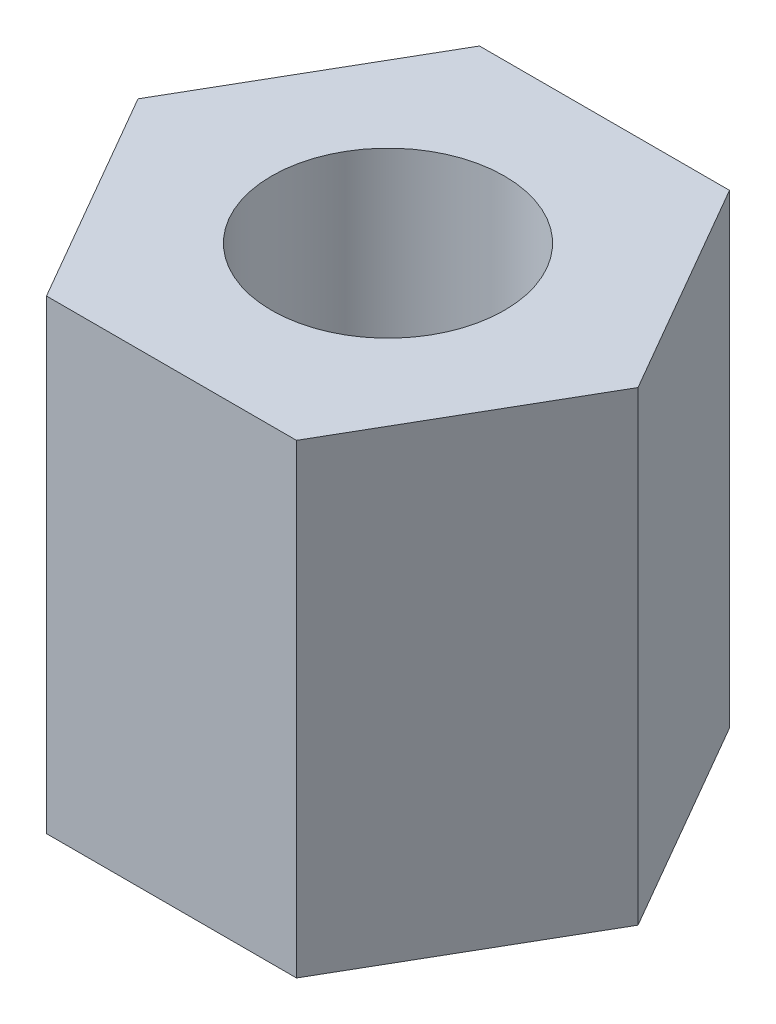
ISO-10303-21;
HEADER;
FILE_DESCRIPTION(('STEP AP214'),'2;1');
FILE_NAME('part.step','',(''),(''),'','','');
FILE_SCHEMA(('AUTOMOTIVE_DESIGN { 1 0 10303 214 1 1 1 1 }'));
ENDSEC;
DATA;
#1=APPLICATION_CONTEXT('core data for automotive mechanical design processes');
#2=APPLICATION_PROTOCOL_DEFINITION('international standard','automotive_design',2000,#1);
#3=PRODUCT_CONTEXT('',#1,'mechanical');
#4=PRODUCT('Part','Part','',(#3));
#5=PRODUCT_RELATED_PRODUCT_CATEGORY('part','',(#4));
#6=PRODUCT_DEFINITION_FORMATION('','',#4);
#7=PRODUCT_DEFINITION_CONTEXT('part definition',#1,'design');
#8=PRODUCT_DEFINITION('design','',#6,#7);
#9=PRODUCT_DEFINITION_SHAPE('','',#8);
#10=(LENGTH_UNIT() NAMED_UNIT(*) SI_UNIT(.MILLI.,.METRE.));
#11=(NAMED_UNIT(*) PLANE_ANGLE_UNIT() SI_UNIT($,.RADIAN.));
#12=(NAMED_UNIT(*) SI_UNIT($,.STERADIAN.) SOLID_ANGLE_UNIT());
#13=UNCERTAINTY_MEASURE_WITH_UNIT(LENGTH_MEASURE(1.E-05),#10,'distance_accuracy_value','');
#14=(GEOMETRIC_REPRESENTATION_CONTEXT(3) GLOBAL_UNCERTAINTY_ASSIGNED_CONTEXT((#13)) GLOBAL_UNIT_ASSIGNED_CONTEXT((#10,
#11,#12)) REPRESENTATION_CONTEXT('',''));
#15=CARTESIAN_POINT('',(0.,0.,0.));
#16=DIRECTION('',(0.,0.,1.));
#17=DIRECTION('',(1.,0.,0.));
#18=AXIS2_PLACEMENT_3D('',#15,#16,#17);
#19=CARTESIAN_POINT('',(1.34233937586591,2.5,2.32499999999999));
#20=DIRECTION('',(-0.866025403784442,0.,-0.499999999999995));
#21=DIRECTION('',(-0.499999999999995,0.,0.866025403784442));
#22=AXIS2_PLACEMENT_3D('',#19,#20,#21);
#23=PLANE('',#22);
#24=DIRECTION('',(0.499999999999995,0.,-0.866025403784442));
#25=VECTOR('',#24,1.);
#26=CARTESIAN_POINT('',(1.34233937586591,-2.5,2.32499999999999));
#27=LINE('',#26,#25);
#28=CARTESIAN_POINT('',(1.34233937586591,-2.5,2.32499999999999));
#29=VERTEX_POINT('',#28);
#30=CARTESIAN_POINT('',(2.68467875173176,-2.5,0.));
#31=VERTEX_POINT('',#30);
#32=EDGE_CURVE('E119',#29,#31,#27,.T.);
#33=ORIENTED_EDGE('',*,*,#32,.T.);
#34=DIRECTION('',(0.,-1.,0.));
#35=VECTOR('',#34,1.);
#36=CARTESIAN_POINT('',(2.68467875173176,2.5,0.));
#37=LINE('',#36,#35);
#38=CARTESIAN_POINT('',(2.68467875173176,2.5,0.));
#39=VERTEX_POINT('',#38);
#40=EDGE_CURVE('E11',#39,#31,#37,.T.);
#41=ORIENTED_EDGE('',*,*,#40,.F.);
#42=DIRECTION('',(0.499999999999995,0.,-0.866025403784442));
#43=VECTOR('',#42,1.);
#44=CARTESIAN_POINT('',(1.34233937586591,2.5,2.32499999999999));
#45=LINE('',#44,#43);
#46=CARTESIAN_POINT('',(1.34233937586591,2.5,2.32499999999999));
#47=VERTEX_POINT('',#46);
#48=EDGE_CURVE('E129',#47,#39,#45,.T.);
#49=ORIENTED_EDGE('',*,*,#48,.F.);
#50=DIRECTION('',(0.,-1.,0.));
#51=VECTOR('',#50,1.);
#52=CARTESIAN_POINT('',(1.34233937586591,2.5,2.32499999999999));
#53=LINE('',#52,#51);
#54=EDGE_CURVE('E115',#47,#29,#53,.T.);
#55=ORIENTED_EDGE('',*,*,#54,.T.);
#56=EDGE_LOOP('',(#33,#41,#49,#55));
#57=FACE_BOUND('',#56,.T.);
#58=ADVANCED_FACE('F34',(#57),#23,.F.);
#59=CARTESIAN_POINT('',(2.68467875173176,2.5,0.));
#60=DIRECTION('',(-0.866025403784438,0.,0.500000000000001));
#61=DIRECTION('',(0.500000000000001,0.,0.866025403784438));
#62=AXIS2_PLACEMENT_3D('',#59,#60,#61);
#63=PLANE('',#62);
#64=DIRECTION('',(-0.500000000000001,0.,-0.866025403784438));
#65=VECTOR('',#64,1.);
#66=CARTESIAN_POINT('',(2.68467875173176,-2.5,0.));
#67=LINE('',#66,#65);
#68=CARTESIAN_POINT('',(1.34233937586588,-2.5,-2.325));
#69=VERTEX_POINT('',#68);
#70=EDGE_CURVE('E122',#31,#69,#67,.T.);
#71=ORIENTED_EDGE('',*,*,#70,.T.);
#72=DIRECTION('',(0.,-1.,0.));
#73=VECTOR('',#72,1.);
#74=CARTESIAN_POINT('',(1.34233937586588,2.5,-2.325));
#75=LINE('',#74,#73);
#76=CARTESIAN_POINT('',(1.34233937586588,2.5,-2.325));
#77=VERTEX_POINT('',#76);
#78=EDGE_CURVE('E43',#77,#69,#75,.T.);
#79=ORIENTED_EDGE('',*,*,#78,.F.);
#80=DIRECTION('',(-0.500000000000001,0.,-0.866025403784438));
#81=VECTOR('',#80,1.);
#82=CARTESIAN_POINT('',(2.68467875173176,2.5,0.));
#83=LINE('',#82,#81);
#84=EDGE_CURVE('E88',#39,#77,#83,.T.);
#85=ORIENTED_EDGE('',*,*,#84,.F.);
#86=ORIENTED_EDGE('',*,*,#40,.T.);
#87=EDGE_LOOP('',(#71,#79,#85,#86));
#88=FACE_BOUND('',#87,.T.);
#89=ADVANCED_FACE('F155',(#88),#63,.F.);
#90=CARTESIAN_POINT('',(1.34233937586588,2.5,-2.325));
#91=DIRECTION('',(0.,0.,1.));
#92=DIRECTION('',(1.,0.,0.));
#93=AXIS2_PLACEMENT_3D('',#90,#91,#92);
#94=PLANE('',#93);
#95=DIRECTION('',(-1.,0.,0.));
#96=VECTOR('',#95,1.);
#97=CARTESIAN_POINT('',(1.34233937586588,-2.5,-2.325));
#98=LINE('',#97,#96);
#99=CARTESIAN_POINT('',(-1.34233937586589,-2.5,-2.32499999999999));
#100=VERTEX_POINT('',#99);
#101=EDGE_CURVE('E124',#69,#100,#98,.T.);
#102=ORIENTED_EDGE('',*,*,#101,.T.);
#103=DIRECTION('',(0.,-1.,0.));
#104=VECTOR('',#103,1.);
#105=CARTESIAN_POINT('',(-1.34233937586589,2.5,-2.32499999999999));
#106=LINE('',#105,#104);
#107=CARTESIAN_POINT('',(-1.34233937586589,2.5,-2.32499999999999));
#108=VERTEX_POINT('',#107);
#109=EDGE_CURVE('E110',#108,#100,#106,.T.);
#110=ORIENTED_EDGE('',*,*,#109,.F.);
#111=DIRECTION('',(-1.,0.,0.));
#112=VECTOR('',#111,1.);
#113=CARTESIAN_POINT('',(1.34233937586588,2.5,-2.325));
#114=LINE('',#113,#112);
#115=EDGE_CURVE('E101',#77,#108,#114,.T.);
#116=ORIENTED_EDGE('',*,*,#115,.F.);
#117=ORIENTED_EDGE('',*,*,#78,.T.);
#118=EDGE_LOOP('',(#102,#110,#116,#117));
#119=FACE_BOUND('',#118,.T.);
#120=ADVANCED_FACE('F136',(#119),#94,.F.);
#121=CARTESIAN_POINT('',(-1.34233937586589,2.5,-2.32499999999999));
#122=DIRECTION('',(0.866025403784441,0.,0.499999999999995));
#123=DIRECTION('',(0.499999999999995,0.,-0.866025403784441));
#124=AXIS2_PLACEMENT_3D('',#121,#122,#123);
#125=PLANE('',#124);
#126=DIRECTION('',(-0.499999999999995,0.,0.866025403784441));
#127=VECTOR('',#126,1.);
#128=CARTESIAN_POINT('',(-1.34233937586589,-2.5,-2.32499999999999));
#129=LINE('',#128,#127);
#130=CARTESIAN_POINT('',(-2.68467875173176,-2.5,0.));
#131=VERTEX_POINT('',#130);
#132=EDGE_CURVE('E109',#100,#131,#129,.T.);
#133=ORIENTED_EDGE('',*,*,#132,.T.);
#134=DIRECTION('',(0.,-1.,0.));
#135=VECTOR('',#134,1.);
#136=CARTESIAN_POINT('',(-2.68467875173176,2.5,0.));
#137=LINE('',#136,#135);
#138=CARTESIAN_POINT('',(-2.68467875173176,2.5,0.));
#139=VERTEX_POINT('',#138);
#140=EDGE_CURVE('E106',#139,#131,#137,.T.);
#141=ORIENTED_EDGE('',*,*,#140,.F.);
#142=DIRECTION('',(-0.499999999999995,0.,0.866025403784441));
#143=VECTOR('',#142,1.);
#144=CARTESIAN_POINT('',(-1.34233937586589,2.5,-2.32499999999999));
#145=LINE('',#144,#143);
#146=EDGE_CURVE('E95',#108,#139,#145,.T.);
#147=ORIENTED_EDGE('',*,*,#146,.F.);
#148=ORIENTED_EDGE('',*,*,#109,.T.);
#149=EDGE_LOOP('',(#133,#141,#147,#148));
#150=FACE_BOUND('',#149,.T.);
#151=ADVANCED_FACE('F107',(#150),#125,.F.);
#152=CARTESIAN_POINT('',(-2.68467875173176,2.5,0.));
#153=DIRECTION('',(0.866025403784434,0.,-0.500000000000007));
#154=DIRECTION('',(-0.500000000000007,0.,-0.866025403784435));
#155=AXIS2_PLACEMENT_3D('',#152,#153,#154);
#156=PLANE('',#155);
#157=DIRECTION('',(0.500000000000007,0.,0.866025403784434));
#158=VECTOR('',#157,1.);
#159=CARTESIAN_POINT('',(-2.68467875173176,-2.5,0.));
#160=LINE('',#159,#158);
#161=CARTESIAN_POINT('',(-1.34233937586586,-2.5,2.32500000000001));
#162=VERTEX_POINT('',#161);
#163=EDGE_CURVE('E74',#131,#162,#160,.T.);
#164=ORIENTED_EDGE('',*,*,#163,.T.);
#165=DIRECTION('',(0.,-1.,0.));
#166=VECTOR('',#165,1.);
#167=CARTESIAN_POINT('',(-1.34233937586586,2.5,2.32500000000001));
#168=LINE('',#167,#166);
#169=CARTESIAN_POINT('',(-1.34233937586586,2.5,2.32500000000001));
#170=VERTEX_POINT('',#169);
#171=EDGE_CURVE('E111',#170,#162,#168,.T.);
#172=ORIENTED_EDGE('',*,*,#171,.F.);
#173=DIRECTION('',(0.500000000000007,0.,0.866025403784434));
#174=VECTOR('',#173,1.);
#175=CARTESIAN_POINT('',(-2.68467875173176,2.5,0.));
#176=LINE('',#175,#174);
#177=EDGE_CURVE('E99',#139,#170,#176,.T.);
#178=ORIENTED_EDGE('',*,*,#177,.F.);
#179=ORIENTED_EDGE('',*,*,#140,.T.);
#180=EDGE_LOOP('',(#164,#172,#178,#179));
#181=FACE_BOUND('',#180,.T.);
#182=ADVANCED_FACE('F113',(#181),#156,.F.);
#183=CARTESIAN_POINT('',(-1.34233937586586,2.5,2.32500000000001));
#184=DIRECTION('',(0.,0.,-1.));
#185=DIRECTION('',(-1.,0.,0.));
#186=AXIS2_PLACEMENT_3D('',#183,#184,#185);
#187=PLANE('',#186);
#188=DIRECTION('',(1.,0.,0.));
#189=VECTOR('',#188,1.);
#190=CARTESIAN_POINT('',(-1.34233937586586,-2.5,2.32500000000001));
#191=LINE('',#190,#189);
#192=EDGE_CURVE('E80',#162,#29,#191,.T.);
#193=ORIENTED_EDGE('',*,*,#192,.T.);
#194=ORIENTED_EDGE('',*,*,#54,.F.);
#195=DIRECTION('',(1.,0.,0.));
#196=VECTOR('',#195,1.);
#197=CARTESIAN_POINT('',(-1.34233937586586,2.5,2.32500000000001));
#198=LINE('',#197,#196);
#199=EDGE_CURVE('E51',#170,#47,#198,.T.);
#200=ORIENTED_EDGE('',*,*,#199,.F.);
#201=ORIENTED_EDGE('',*,*,#171,.T.);
#202=EDGE_LOOP('',(#193,#194,#200,#201));
#203=FACE_BOUND('',#202,.T.);
#204=ADVANCED_FACE('F143',(#203),#187,.F.);
#205=CARTESIAN_POINT('',(0.,2.5,0.));
#206=DIRECTION('',(0.,1.,0.));
#207=DIRECTION('',(0.,0.,1.));
#208=AXIS2_PLACEMENT_3D('',#205,#206,#207);
#209=PLANE('',#208);
#210=CARTESIAN_POINT('',(0.,2.5,0.));
#211=DIRECTION('',(0.,1.,0.));
#212=DIRECTION('',(0.,0.,1.));
#213=AXIS2_PLACEMENT_3D('',#210,#211,#212);
#214=CIRCLE('',#213,1.24999999999999);
#215=CARTESIAN_POINT('',(0.,2.5,1.24999999999999));
#216=VERTEX_POINT('',#215);
#217=EDGE_CURVE('E37',#216,#216,#214,.T.);
#218=ORIENTED_EDGE('',*,*,#217,.F.);
#219=EDGE_LOOP('',(#218));
#220=FACE_BOUND('',#219,.T.);
#221=ORIENTED_EDGE('',*,*,#48,.T.);
#222=ORIENTED_EDGE('',*,*,#84,.T.);
#223=ORIENTED_EDGE('',*,*,#115,.T.);
#224=ORIENTED_EDGE('',*,*,#146,.T.);
#225=ORIENTED_EDGE('',*,*,#177,.T.);
#226=ORIENTED_EDGE('',*,*,#199,.T.);
#227=EDGE_LOOP('',(#221,#222,#223,#224,#225,#226));
#228=FACE_BOUND('',#227,.T.);
#229=ADVANCED_FACE('F97',(#220,#228),#209,.T.);
#230=CARTESIAN_POINT('',(0.,-2.5,0.));
#231=DIRECTION('',(0.,1.,0.));
#232=DIRECTION('',(0.,0.,1.));
#233=AXIS2_PLACEMENT_3D('',#230,#231,#232);
#234=PLANE('',#233);
#235=CARTESIAN_POINT('',(0.,-2.5,0.));
#236=DIRECTION('',(0.,-1.,0.));
#237=DIRECTION('',(0.,0.,-1.));
#238=AXIS2_PLACEMENT_3D('',#235,#236,#237);
#239=CIRCLE('',#238,1.24999999999999);
#240=CARTESIAN_POINT('',(0.,-2.5,-1.24999999999999));
#241=VERTEX_POINT('',#240);
#242=EDGE_CURVE('E212',#241,#241,#239,.T.);
#243=ORIENTED_EDGE('',*,*,#242,.F.);
#244=EDGE_LOOP('',(#243));
#245=FACE_BOUND('',#244,.T.);
#246=ORIENTED_EDGE('',*,*,#32,.F.);
#247=ORIENTED_EDGE('',*,*,#192,.F.);
#248=ORIENTED_EDGE('',*,*,#163,.F.);
#249=ORIENTED_EDGE('',*,*,#132,.F.);
#250=ORIENTED_EDGE('',*,*,#101,.F.);
#251=ORIENTED_EDGE('',*,*,#70,.F.);
#252=EDGE_LOOP('',(#246,#247,#248,#249,#250,#251));
#253=FACE_BOUND('',#252,.T.);
#254=ADVANCED_FACE('F139',(#245,#253),#234,.F.);
#255=CARTESIAN_POINT('',(0.,-2.5,0.));
#256=DIRECTION('',(0.,-1.,0.));
#257=DIRECTION('',(0.,0.,-1.));
#258=AXIS2_PLACEMENT_3D('',#255,#256,#257);
#259=CYLINDRICAL_SURFACE('',#258,1.24999999999999);
#260=ORIENTED_EDGE('',*,*,#217,.T.);
#261=EDGE_LOOP('',(#260));
#262=FACE_BOUND('',#261,.T.);
#263=ORIENTED_EDGE('',*,*,#242,.T.);
#264=EDGE_LOOP('',(#263));
#265=FACE_BOUND('',#264,.T.);
#266=ADVANCED_FACE('F192',(#262,#265),#259,.F.);
#267=CLOSED_SHELL('',(#58,#89,#120,#151,#182,#204,#229,#254,#266));
#268=MANIFOLD_SOLID_BREP('B2',#267);
#269=ADVANCED_BREP_SHAPE_REPRESENTATION('',(#18,#268),#14);
#270=SHAPE_DEFINITION_REPRESENTATION(#9,#269);
ENDSEC;
END-ISO-10303-21;
